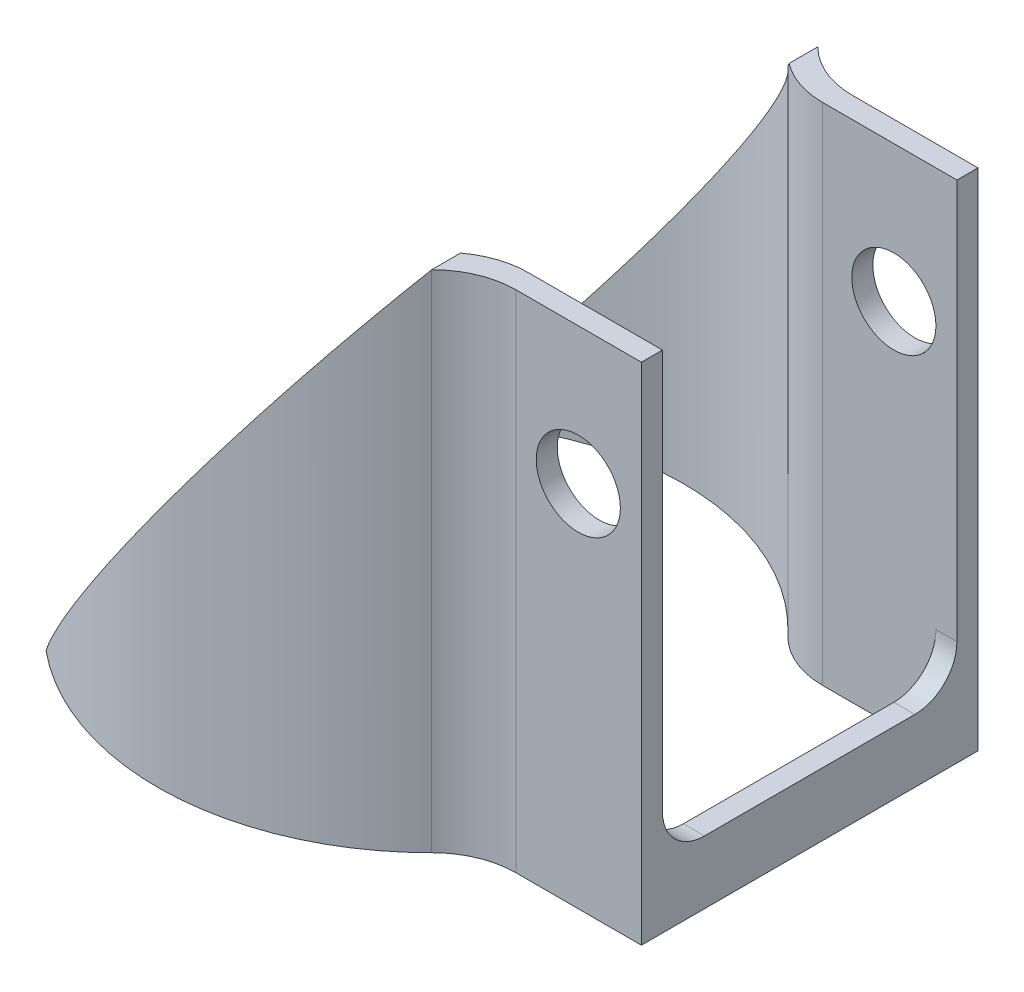
ISO-10303-21;
HEADER;
FILE_DESCRIPTION(('STEP AP214'),'2;1');
FILE_NAME('part.step','',(''),(''),'','','');
FILE_SCHEMA(('AUTOMOTIVE_DESIGN { 1 0 10303 214 1 1 1 1 }'));
ENDSEC;
DATA;
#1=APPLICATION_CONTEXT('core data for automotive mechanical design processes');
#2=APPLICATION_PROTOCOL_DEFINITION('international standard','automotive_design',2000,#1);
#3=PRODUCT_CONTEXT('',#1,'mechanical');
#4=PRODUCT('Part','Part','',(#3));
#5=PRODUCT_RELATED_PRODUCT_CATEGORY('part','',(#4));
#6=PRODUCT_DEFINITION_FORMATION('','',#4);
#7=PRODUCT_DEFINITION_CONTEXT('part definition',#1,'design');
#8=PRODUCT_DEFINITION('design','',#6,#7);
#9=PRODUCT_DEFINITION_SHAPE('','',#8);
#10=(LENGTH_UNIT() NAMED_UNIT(*) SI_UNIT(.MILLI.,.METRE.));
#11=(NAMED_UNIT(*) PLANE_ANGLE_UNIT() SI_UNIT($,.RADIAN.));
#12=(NAMED_UNIT(*) SI_UNIT($,.STERADIAN.) SOLID_ANGLE_UNIT());
#13=UNCERTAINTY_MEASURE_WITH_UNIT(LENGTH_MEASURE(1.E-05),#10,'distance_accuracy_value','');
#14=(GEOMETRIC_REPRESENTATION_CONTEXT(3) GLOBAL_UNCERTAINTY_ASSIGNED_CONTEXT((#13)) GLOBAL_UNIT_ASSIGNED_CONTEXT((#10,
#11,#12)) REPRESENTATION_CONTEXT('',''));
#15=CARTESIAN_POINT('',(0.,0.,0.));
#16=DIRECTION('',(0.,0.,1.));
#17=DIRECTION('',(1.,0.,0.));
#18=AXIS2_PLACEMENT_3D('',#15,#16,#17);
#19=CARTESIAN_POINT('',(0.,24.,0.));
#20=DIRECTION('',(0.,1.,0.));
#21=DIRECTION('',(0.,0.,1.));
#22=AXIS2_PLACEMENT_3D('',#19,#20,#21);
#23=PLANE('',#22);
#24=DIRECTION('',(0.,0.,-1.));
#25=VECTOR('',#24,1.);
#26=CARTESIAN_POINT('',(18.,24.,8.));
#27=LINE('',#26,#25);
#28=CARTESIAN_POINT('',(18.,24.,8.));
#29=VERTEX_POINT('',#28);
#30=CARTESIAN_POINT('',(18.,24.,7.));
#31=VERTEX_POINT('',#30);
#32=EDGE_CURVE('E189',#29,#31,#27,.T.);
#33=ORIENTED_EDGE('',*,*,#32,.T.);
#34=DIRECTION('',(1.,0.,0.));
#35=VECTOR('',#34,1.);
#36=CARTESIAN_POINT('',(17.,24.,7.));
#37=LINE('',#36,#35);
#38=CARTESIAN_POINT('',(11.6189500386223,24.,7.));
#39=VERTEX_POINT('',#38);
#40=EDGE_CURVE('E173',#39,#31,#37,.T.);
#41=ORIENTED_EDGE('',*,*,#40,.F.);
#42=CARTESIAN_POINT('',(11.6189500386223,24.,11.));
#43=DIRECTION('',(0.,1.,0.));
#44=DIRECTION('',(0.,0.,1.));
#45=AXIS2_PLACEMENT_3D('',#42,#43,#44);
#46=CIRCLE('',#45,4.);
#47=CARTESIAN_POINT('',(9.20827820731175,24.,7.80803174800781));
#48=VERTEX_POINT('',#47);
#49=EDGE_CURVE('E226',#39,#48,#46,.T.);
#50=ORIENTED_EDGE('',*,*,#49,.T.);
#51=DIRECTION('',(0.,0.,1.));
#52=VECTOR('',#51,1.);
#53=CARTESIAN_POINT('',(9.20827820731175,24.,-13.));
#54=LINE('',#53,#52);
#55=CARTESIAN_POINT('',(9.20827820731175,24.,9.17647058823528));
#56=VERTEX_POINT('',#55);
#57=EDGE_CURVE('E297',#48,#56,#54,.T.);
#58=ORIENTED_EDGE('',*,*,#57,.T.);
#59=CARTESIAN_POINT('',(12.0415945787923,24.,12.));
#60=DIRECTION('',(0.,1.,0.));
#61=DIRECTION('',(0.,0.,1.));
#62=AXIS2_PLACEMENT_3D('',#59,#60,#61);
#63=CIRCLE('',#62,4.);
#64=CARTESIAN_POINT('',(12.0415945787923,24.,8.));
#65=VERTEX_POINT('',#64);
#66=EDGE_CURVE('E251',#56,#65,#63,.F.);
#67=ORIENTED_EDGE('',*,*,#66,.T.);
#68=DIRECTION('',(1.,0.,0.));
#69=VECTOR('',#68,1.);
#70=CARTESIAN_POINT('',(18.,24.,8.));
#71=LINE('',#70,#69);
#72=EDGE_CURVE('E200',#65,#29,#71,.T.);
#73=ORIENTED_EDGE('',*,*,#72,.T.);
#74=EDGE_LOOP('',(#33,#41,#50,#58,#67,#73));
#75=FACE_BOUND('',#74,.T.);
#76=ADVANCED_FACE('F33',(#75),#23,.T.);
#77=CARTESIAN_POINT('',(18.,24.,8.));
#78=DIRECTION('',(-1.,0.,0.));
#79=DIRECTION('',(0.,0.,1.));
#80=AXIS2_PLACEMENT_3D('',#77,#78,#79);
#81=PLANE('',#80);
#82=DIRECTION('',(0.,-1.,0.));
#83=VECTOR('',#82,1.);
#84=CARTESIAN_POINT('',(18.,24.,7.));
#85=LINE('',#84,#83);
#86=CARTESIAN_POINT('',(18.,5.,7.));
#87=VERTEX_POINT('',#86);
#88=EDGE_CURVE('E181',#31,#87,#85,.T.);
#89=ORIENTED_EDGE('',*,*,#88,.F.);
#90=ORIENTED_EDGE('',*,*,#32,.F.);
#91=DIRECTION('',(0.,-1.,0.));
#92=VECTOR('',#91,1.);
#93=CARTESIAN_POINT('',(18.,24.,8.));
#94=LINE('',#93,#92);
#95=CARTESIAN_POINT('',(18.,0.,8.));
#96=VERTEX_POINT('',#95);
#97=EDGE_CURVE('E202',#29,#96,#94,.T.);
#98=ORIENTED_EDGE('',*,*,#97,.T.);
#99=DIRECTION('',(0.,0.,-1.));
#100=VECTOR('',#99,1.);
#101=CARTESIAN_POINT('',(18.,0.,8.));
#102=LINE('',#101,#100);
#103=CARTESIAN_POINT('',(18.,0.,-8.));
#104=VERTEX_POINT('',#103);
#105=EDGE_CURVE('E203',#96,#104,#102,.T.);
#106=ORIENTED_EDGE('',*,*,#105,.T.);
#107=DIRECTION('',(0.,-1.,0.));
#108=VECTOR('',#107,1.);
#109=CARTESIAN_POINT('',(18.,24.,-8.));
#110=LINE('',#109,#108);
#111=CARTESIAN_POINT('',(18.,24.,-8.));
#112=VERTEX_POINT('',#111);
#113=EDGE_CURVE('E188',#112,#104,#110,.T.);
#114=ORIENTED_EDGE('',*,*,#113,.F.);
#115=CARTESIAN_POINT('',(18.,24.,-7.00000000000001));
#116=VERTEX_POINT('',#115);
#117=EDGE_CURVE('E167',#116,#112,#27,.T.);
#118=ORIENTED_EDGE('',*,*,#117,.F.);
#119=DIRECTION('',(0.,-1.,0.));
#120=VECTOR('',#119,1.);
#121=CARTESIAN_POINT('',(18.,24.,-7.00000000000001));
#122=LINE('',#121,#120);
#123=CARTESIAN_POINT('',(18.,5.,-7.00000000000001));
#124=VERTEX_POINT('',#123);
#125=EDGE_CURVE('E177',#116,#124,#122,.T.);
#126=ORIENTED_EDGE('',*,*,#125,.T.);
#127=CARTESIAN_POINT('',(18.,5.,-5.));
#128=DIRECTION('',(-1.,0.,0.));
#129=DIRECTION('',(0.,0.,1.));
#130=AXIS2_PLACEMENT_3D('',#127,#128,#129);
#131=CIRCLE('',#130,2.);
#132=CARTESIAN_POINT('',(18.,3.,-5.));
#133=VERTEX_POINT('',#132);
#134=EDGE_CURVE('E41',#124,#133,#131,.T.);
#135=ORIENTED_EDGE('',*,*,#134,.T.);
#136=DIRECTION('',(0.,0.,-1.));
#137=VECTOR('',#136,1.);
#138=CARTESIAN_POINT('',(18.,3.,8.));
#139=LINE('',#138,#137);
#140=CARTESIAN_POINT('',(18.,3.,5.));
#141=VERTEX_POINT('',#140);
#142=EDGE_CURVE('E272',#141,#133,#139,.T.);
#143=ORIENTED_EDGE('',*,*,#142,.F.);
#144=CARTESIAN_POINT('',(18.,5.,5.));
#145=DIRECTION('',(-1.,0.,0.));
#146=DIRECTION('',(0.,0.,1.));
#147=AXIS2_PLACEMENT_3D('',#144,#145,#146);
#148=CIRCLE('',#147,2.);
#149=EDGE_CURVE('E267',#141,#87,#148,.T.);
#150=ORIENTED_EDGE('',*,*,#149,.T.);
#151=EDGE_LOOP('',(#89,#90,#98,#106,#114,#118,#126,#135,#143,#150));
#152=FACE_BOUND('',#151,.T.);
#153=ADVANCED_FACE('F185',(#152),#81,.F.);
#154=CARTESIAN_POINT('',(17.,24.,7.));
#155=DIRECTION('',(-1.,0.,0.));
#156=DIRECTION('',(0.,0.,1.));
#157=AXIS2_PLACEMENT_3D('',#154,#155,#156);
#158=PLANE('',#157);
#159=DIRECTION('',(0.,-1.,0.));
#160=VECTOR('',#159,1.);
#161=CARTESIAN_POINT('',(17.,24.,7.));
#162=LINE('',#161,#160);
#163=CARTESIAN_POINT('',(17.,5.,7.));
#164=VERTEX_POINT('',#163);
#165=CARTESIAN_POINT('',(17.,0.,7.));
#166=VERTEX_POINT('',#165);
#167=EDGE_CURVE('E316',#164,#166,#162,.T.);
#168=ORIENTED_EDGE('',*,*,#167,.F.);
#169=CARTESIAN_POINT('',(17.,5.,5.));
#170=DIRECTION('',(-1.,0.,0.));
#171=DIRECTION('',(0.,0.,1.));
#172=AXIS2_PLACEMENT_3D('',#169,#170,#171);
#173=CIRCLE('',#172,2.);
#174=CARTESIAN_POINT('',(17.,3.,5.));
#175=VERTEX_POINT('',#174);
#176=EDGE_CURVE('E269',#164,#175,#173,.F.);
#177=ORIENTED_EDGE('',*,*,#176,.T.);
#178=DIRECTION('',(0.,0.,-1.));
#179=VECTOR('',#178,1.);
#180=CARTESIAN_POINT('',(17.,3.,7.));
#181=LINE('',#180,#179);
#182=CARTESIAN_POINT('',(17.,3.,-5.));
#183=VERTEX_POINT('',#182);
#184=EDGE_CURVE('E278',#175,#183,#181,.T.);
#185=ORIENTED_EDGE('',*,*,#184,.T.);
#186=CARTESIAN_POINT('',(17.,5.,-5.));
#187=DIRECTION('',(-1.,0.,0.));
#188=DIRECTION('',(0.,0.,1.));
#189=AXIS2_PLACEMENT_3D('',#186,#187,#188);
#190=CIRCLE('',#189,2.);
#191=CARTESIAN_POINT('',(17.,5.,-7.));
#192=VERTEX_POINT('',#191);
#193=EDGE_CURVE('E11',#183,#192,#190,.F.);
#194=ORIENTED_EDGE('',*,*,#193,.T.);
#195=DIRECTION('',(0.,-1.,0.));
#196=VECTOR('',#195,1.);
#197=CARTESIAN_POINT('',(17.,24.,-7.));
#198=LINE('',#197,#196);
#199=CARTESIAN_POINT('',(17.,0.,-7.));
#200=VERTEX_POINT('',#199);
#201=EDGE_CURVE('E48',#192,#200,#198,.T.);
#202=ORIENTED_EDGE('',*,*,#201,.T.);
#203=DIRECTION('',(0.,0.,-1.));
#204=VECTOR('',#203,1.);
#205=CARTESIAN_POINT('',(17.,0.,7.));
#206=LINE('',#205,#204);
#207=EDGE_CURVE('E312',#166,#200,#206,.T.);
#208=ORIENTED_EDGE('',*,*,#207,.F.);
#209=EDGE_LOOP('',(#168,#177,#185,#194,#202,#208));
#210=FACE_BOUND('',#209,.T.);
#211=ADVANCED_FACE('F282',(#210),#158,.T.);
#212=CARTESIAN_POINT('',(0.,24.,0.));
#213=DIRECTION('',(0.,-1.,0.));
#214=DIRECTION('',(0.,0.,-1.));
#215=AXIS2_PLACEMENT_3D('',#212,#213,#214);
#216=CYLINDRICAL_SURFACE('',#215,13.);
#217=CARTESIAN_POINT('',(0.,0.,0.));
#218=DIRECTION('',(0.,1.,0.));
#219=DIRECTION('',(0.,0.,1.));
#220=AXIS2_PLACEMENT_3D('',#217,#218,#219);
#221=CIRCLE('',#220,13.);
#222=CARTESIAN_POINT('',(9.20827820731175,0.,-9.1764705882353));
#223=VERTEX_POINT('',#222);
#224=CARTESIAN_POINT('',(-8.27878892488248,0.,-10.0230561176341));
#225=VERTEX_POINT('',#224);
#226=EDGE_CURVE('E194',#223,#225,#221,.T.);
#227=ORIENTED_EDGE('',*,*,#226,.T.);
#228=CARTESIAN_POINT('',(0.,11.3621645468143,0.));
#229=DIRECTION('',(0.80821481299193,-0.58888777883432,0.));
#230=DIRECTION('',(-0.58888777883432,-0.80821481299193,0.));
#231=AXIS2_PLACEMENT_3D('',#228,#229,#230);
#232=ELLIPSE('',#231,22.0755133104188,13.);
#233=CARTESIAN_POINT('',(9.20827820731175,24.,-9.17647058823529));
#234=VERTEX_POINT('',#233);
#235=EDGE_CURVE('E311',#225,#234,#232,.T.);
#236=ORIENTED_EDGE('',*,*,#235,.T.);
#237=DIRECTION('',(0.,-1.,0.));
#238=VECTOR('',#237,1.);
#239=CARTESIAN_POINT('',(9.20827820731175,24.,-9.1764705882353));
#240=LINE('',#239,#238);
#241=EDGE_CURVE('E235',#234,#223,#240,.T.);
#242=ORIENTED_EDGE('',*,*,#241,.T.);
#243=EDGE_LOOP('',(#227,#236,#242));
#244=FACE_BOUND('',#243,.T.);
#245=ADVANCED_FACE('F374',(#244),#216,.T.);
#246=CARTESIAN_POINT('',(0.,24.,0.));
#247=DIRECTION('',(0.,-1.,0.));
#248=DIRECTION('',(0.,0.,-1.));
#249=AXIS2_PLACEMENT_3D('',#246,#247,#248);
#250=CYLINDRICAL_SURFACE('',#249,12.);
#251=CARTESIAN_POINT('',(0.,11.3621645468143,0.));
#252=DIRECTION('',(0.80821481299193,-0.58888777883432,0.));
#253=DIRECTION('',(-0.58888777883432,-0.80821481299193,0.));
#254=AXIS2_PLACEMENT_3D('',#251,#252,#253);
#255=ELLIPSE('',#254,20.377396901925,12.);
#256=CARTESIAN_POINT('',(-8.27878892488248,0.,-8.68686675028708));
#257=VERTEX_POINT('',#256);
#258=CARTESIAN_POINT('',(8.71421252896669,23.3219230994744,-8.25));
#259=VERTEX_POINT('',#258);
#260=EDGE_CURVE('E309',#257,#259,#255,.T.);
#261=ORIENTED_EDGE('',*,*,#260,.F.);
#262=CARTESIAN_POINT('',(0.,0.,0.));
#263=DIRECTION('',(0.,1.,0.));
#264=DIRECTION('',(0.,0.,1.));
#265=AXIS2_PLACEMENT_3D('',#262,#263,#264);
#266=CIRCLE('',#265,12.);
#267=CARTESIAN_POINT('',(8.71421252896669,0.,-8.25));
#268=VERTEX_POINT('',#267);
#269=EDGE_CURVE('E323',#268,#257,#266,.T.);
#270=ORIENTED_EDGE('',*,*,#269,.F.);
#271=DIRECTION('',(0.,-1.,0.));
#272=VECTOR('',#271,1.);
#273=CARTESIAN_POINT('',(8.71421252896669,24.,-8.25));
#274=LINE('',#273,#272);
#275=EDGE_CURVE('E223',#268,#259,#274,.F.);
#276=ORIENTED_EDGE('',*,*,#275,.T.);
#277=EDGE_LOOP('',(#261,#270,#276));
#278=FACE_BOUND('',#277,.T.);
#279=ADVANCED_FACE('F368',(#278),#250,.F.);
#280=DIRECTION('',(-1.,0.,0.));
#281=VECTOR('',#280,1.);
#282=CARTESIAN_POINT('',(17.,24.,-7.));
#283=LINE('',#282,#281);
#284=CARTESIAN_POINT('',(11.6189500386222,24.,-7.));
#285=VERTEX_POINT('',#284);
#286=EDGE_CURVE('E162',#116,#285,#283,.T.);
#287=ORIENTED_EDGE('',*,*,#286,.F.);
#288=ORIENTED_EDGE('',*,*,#117,.T.);
#289=DIRECTION('',(-1.,0.,0.));
#290=VECTOR('',#289,1.);
#291=CARTESIAN_POINT('',(18.,24.,-8.));
#292=LINE('',#291,#290);
#293=CARTESIAN_POINT('',(12.0415945787923,24.,-8.));
#294=VERTEX_POINT('',#293);
#295=EDGE_CURVE('E193',#112,#294,#292,.T.);
#296=ORIENTED_EDGE('',*,*,#295,.T.);
#297=CARTESIAN_POINT('',(12.0415945787923,24.,-12.));
#298=DIRECTION('',(0.,1.,0.));
#299=DIRECTION('',(0.,0.,1.));
#300=AXIS2_PLACEMENT_3D('',#297,#298,#299);
#301=CIRCLE('',#300,4.);
#302=EDGE_CURVE('E245',#294,#234,#301,.F.);
#303=ORIENTED_EDGE('',*,*,#302,.T.);
#304=CARTESIAN_POINT('',(9.20827820731175,24.,-7.80803174800781));
#305=VERTEX_POINT('',#304);
#306=EDGE_CURVE('E300',#234,#305,#54,.T.);
#307=ORIENTED_EDGE('',*,*,#306,.T.);
#308=CARTESIAN_POINT('',(11.6189500386222,24.,-11.));
#309=DIRECTION('',(0.,1.,0.));
#310=DIRECTION('',(0.,0.,1.));
#311=AXIS2_PLACEMENT_3D('',#308,#309,#310);
#312=CIRCLE('',#311,4.);
#313=EDGE_CURVE('E171',#305,#285,#312,.T.);
#314=ORIENTED_EDGE('',*,*,#313,.T.);
#315=EDGE_LOOP('',(#287,#288,#296,#303,#307,#314));
#316=FACE_BOUND('',#315,.T.);
#317=ADVANCED_FACE('F164',(#316),#23,.T.);
#318=CARTESIAN_POINT('',(0.,0.,0.));
#319=DIRECTION('',(0.,1.,0.));
#320=DIRECTION('',(0.,0.,1.));
#321=AXIS2_PLACEMENT_3D('',#318,#319,#320);
#322=PLANE('',#321);
#323=CARTESIAN_POINT('',(-8.27878892488248,0.,10.0230561176341));
#324=VERTEX_POINT('',#323);
#325=CARTESIAN_POINT('',(9.20827820731175,0.,9.17647058823529));
#326=VERTEX_POINT('',#325);
#327=EDGE_CURVE('E208',#324,#326,#221,.T.);
#328=ORIENTED_EDGE('',*,*,#327,.F.);
#329=DIRECTION('',(0.,0.,1.));
#330=VECTOR('',#329,1.);
#331=CARTESIAN_POINT('',(-8.27878892488248,0.,-13.));
#332=LINE('',#331,#330);
#333=CARTESIAN_POINT('',(-8.27878892488248,0.,8.68686675028708));
#334=VERTEX_POINT('',#333);
#335=EDGE_CURVE('E296',#334,#324,#332,.T.);
#336=ORIENTED_EDGE('',*,*,#335,.F.);
#337=CARTESIAN_POINT('',(8.71421252896669,0.,8.25));
#338=VERTEX_POINT('',#337);
#339=EDGE_CURVE('E322',#334,#338,#266,.T.);
#340=ORIENTED_EDGE('',*,*,#339,.T.);
#341=CARTESIAN_POINT('',(11.6189500386223,0.,11.));
#342=DIRECTION('',(0.,1.,0.));
#343=DIRECTION('',(0.,0.,1.));
#344=AXIS2_PLACEMENT_3D('',#341,#342,#343);
#345=CIRCLE('',#344,4.);
#346=CARTESIAN_POINT('',(11.6189500386223,0.,7.));
#347=VERTEX_POINT('',#346);
#348=EDGE_CURVE('E216',#338,#347,#345,.F.);
#349=ORIENTED_EDGE('',*,*,#348,.T.);
#350=DIRECTION('',(1.,0.,0.));
#351=VECTOR('',#350,1.);
#352=CARTESIAN_POINT('',(17.,0.,7.));
#353=LINE('',#352,#351);
#354=EDGE_CURVE('E174',#347,#166,#353,.T.);
#355=ORIENTED_EDGE('',*,*,#354,.T.);
#356=ORIENTED_EDGE('',*,*,#207,.T.);
#357=DIRECTION('',(-1.,0.,0.));
#358=VECTOR('',#357,1.);
#359=CARTESIAN_POINT('',(17.,0.,-7.));
#360=LINE('',#359,#358);
#361=CARTESIAN_POINT('',(11.6189500386222,0.,-7.));
#362=VERTEX_POINT('',#361);
#363=EDGE_CURVE('E319',#200,#362,#360,.T.);
#364=ORIENTED_EDGE('',*,*,#363,.T.);
#365=CARTESIAN_POINT('',(11.6189500386222,0.,-11.));
#366=DIRECTION('',(0.,1.,0.));
#367=DIRECTION('',(0.,0.,1.));
#368=AXIS2_PLACEMENT_3D('',#365,#366,#367);
#369=CIRCLE('',#368,4.);
#370=EDGE_CURVE('E218',#362,#268,#369,.F.);
#371=ORIENTED_EDGE('',*,*,#370,.T.);
#372=ORIENTED_EDGE('',*,*,#269,.T.);
#373=EDGE_CURVE('E301',#225,#257,#332,.T.);
#374=ORIENTED_EDGE('',*,*,#373,.F.);
#375=ORIENTED_EDGE('',*,*,#226,.F.);
#376=CARTESIAN_POINT('',(12.0415945787923,0.,-12.));
#377=DIRECTION('',(0.,1.,0.));
#378=DIRECTION('',(0.,0.,1.));
#379=AXIS2_PLACEMENT_3D('',#376,#377,#378);
#380=CIRCLE('',#379,4.);
#381=CARTESIAN_POINT('',(12.0415945787923,0.,-8.));
#382=VERTEX_POINT('',#381);
#383=EDGE_CURVE('E243',#223,#382,#380,.T.);
#384=ORIENTED_EDGE('',*,*,#383,.T.);
#385=DIRECTION('',(-1.,0.,0.));
#386=VECTOR('',#385,1.);
#387=CARTESIAN_POINT('',(18.,0.,-8.));
#388=LINE('',#387,#386);
#389=EDGE_CURVE('E205',#104,#382,#388,.T.);
#390=ORIENTED_EDGE('',*,*,#389,.F.);
#391=ORIENTED_EDGE('',*,*,#105,.F.);
#392=DIRECTION('',(1.,0.,0.));
#393=VECTOR('',#392,1.);
#394=CARTESIAN_POINT('',(18.,0.,8.));
#395=LINE('',#394,#393);
#396=CARTESIAN_POINT('',(12.0415945787923,0.,8.));
#397=VERTEX_POINT('',#396);
#398=EDGE_CURVE('E190',#397,#96,#395,.T.);
#399=ORIENTED_EDGE('',*,*,#398,.F.);
#400=CARTESIAN_POINT('',(12.0415945787923,0.,12.));
#401=DIRECTION('',(0.,1.,0.));
#402=DIRECTION('',(0.,0.,1.));
#403=AXIS2_PLACEMENT_3D('',#400,#401,#402);
#404=CIRCLE('',#403,4.);
#405=EDGE_CURVE('E248',#397,#326,#404,.T.);
#406=ORIENTED_EDGE('',*,*,#405,.T.);
#407=EDGE_LOOP('',(#328,#336,#340,#349,#355,#356,#364,#371,#372,#374,#375,#384,#390,#391,#399,#406));
#408=FACE_BOUND('',#407,.T.);
#409=ADVANCED_FACE('F334',(#408),#322,.F.);
#410=CARTESIAN_POINT('',(18.,24.,-8.));
#411=DIRECTION('',(0.,0.,1.));
#412=DIRECTION('',(1.,0.,0.));
#413=AXIS2_PLACEMENT_3D('',#410,#411,#412);
#414=PLANE('',#413);
#415=CARTESIAN_POINT('',(15.,17.5,-8.));
#416=DIRECTION('',(0.,0.,1.));
#417=DIRECTION('',(1.,0.,0.));
#418=AXIS2_PLACEMENT_3D('',#415,#416,#417);
#419=CIRCLE('',#418,2.);
#420=CARTESIAN_POINT('',(17.,17.5,-8.));
#421=VERTEX_POINT('',#420);
#422=EDGE_CURVE('E293',#421,#421,#419,.T.);
#423=ORIENTED_EDGE('',*,*,#422,.T.);
#424=EDGE_LOOP('',(#423));
#425=FACE_BOUND('',#424,.T.);
#426=ORIENTED_EDGE('',*,*,#389,.T.);
#427=DIRECTION('',(0.,1.,0.));
#428=VECTOR('',#427,1.);
#429=CARTESIAN_POINT('',(12.0415945787923,24.,-8.));
#430=LINE('',#429,#428);
#431=EDGE_CURVE('E238',#382,#294,#430,.T.);
#432=ORIENTED_EDGE('',*,*,#431,.T.);
#433=ORIENTED_EDGE('',*,*,#295,.F.);
#434=ORIENTED_EDGE('',*,*,#113,.T.);
#435=EDGE_LOOP('',(#426,#432,#433,#434));
#436=FACE_BOUND('',#435,.T.);
#437=ADVANCED_FACE('F373',(#425,#436),#414,.F.);
#438=DIRECTION('',(0.,-1.,0.));
#439=VECTOR('',#438,1.);
#440=CARTESIAN_POINT('',(9.20827820731175,24.,9.1764705882353));
#441=LINE('',#440,#439);
#442=EDGE_CURVE('E232',#326,#56,#441,.F.);
#443=ORIENTED_EDGE('',*,*,#442,.T.);
#444=EDGE_CURVE('E313',#56,#324,#232,.T.);
#445=ORIENTED_EDGE('',*,*,#444,.T.);
#446=ORIENTED_EDGE('',*,*,#327,.T.);
#447=EDGE_LOOP('',(#443,#445,#446));
#448=FACE_BOUND('',#447,.T.);
#449=ADVANCED_FACE('F383',(#448),#216,.T.);
#450=CARTESIAN_POINT('',(18.,24.,8.));
#451=DIRECTION('',(0.,0.,-1.));
#452=DIRECTION('',(-1.,0.,0.));
#453=AXIS2_PLACEMENT_3D('',#450,#451,#452);
#454=PLANE('',#453);
#455=CARTESIAN_POINT('',(15.,17.5,8.));
#456=DIRECTION('',(0.,0.,1.));
#457=DIRECTION('',(1.,0.,0.));
#458=AXIS2_PLACEMENT_3D('',#455,#456,#457);
#459=CIRCLE('',#458,2.);
#460=CARTESIAN_POINT('',(17.,17.5,8.));
#461=VERTEX_POINT('',#460);
#462=EDGE_CURVE('E258',#461,#461,#459,.T.);
#463=ORIENTED_EDGE('',*,*,#462,.F.);
#464=EDGE_LOOP('',(#463));
#465=FACE_BOUND('',#464,.T.);
#466=ORIENTED_EDGE('',*,*,#72,.F.);
#467=DIRECTION('',(0.,1.,0.));
#468=VECTOR('',#467,1.);
#469=CARTESIAN_POINT('',(12.0415945787923,0.,8.));
#470=LINE('',#469,#468);
#471=EDGE_CURVE('E240',#65,#397,#470,.F.);
#472=ORIENTED_EDGE('',*,*,#471,.T.);
#473=ORIENTED_EDGE('',*,*,#398,.T.);
#474=ORIENTED_EDGE('',*,*,#97,.F.);
#475=EDGE_LOOP('',(#466,#472,#473,#474));
#476=FACE_BOUND('',#475,.T.);
#477=ADVANCED_FACE('F395',(#465,#476),#454,.F.);
#478=CARTESIAN_POINT('',(17.,24.,-7.));
#479=DIRECTION('',(0.,0.,1.));
#480=DIRECTION('',(1.,0.,0.));
#481=AXIS2_PLACEMENT_3D('',#478,#479,#480);
#482=PLANE('',#481);
#483=CARTESIAN_POINT('',(15.,17.5,-7.));
#484=DIRECTION('',(0.,0.,1.));
#485=DIRECTION('',(1.,0.,0.));
#486=AXIS2_PLACEMENT_3D('',#483,#484,#485);
#487=CIRCLE('',#486,2.);
#488=CARTESIAN_POINT('',(17.,17.5,-7.));
#489=VERTEX_POINT('',#488);
#490=EDGE_CURVE('E257',#489,#489,#487,.T.);
#491=ORIENTED_EDGE('',*,*,#490,.F.);
#492=EDGE_LOOP('',(#491));
#493=FACE_BOUND('',#492,.T.);
#494=ORIENTED_EDGE('',*,*,#201,.F.);
#495=DIRECTION('',(1.,0.,0.));
#496=VECTOR('',#495,1.);
#497=CARTESIAN_POINT('',(18.,5.,-7.));
#498=LINE('',#497,#496);
#499=EDGE_CURVE('E179',#192,#124,#498,.T.);
#500=ORIENTED_EDGE('',*,*,#499,.T.);
#501=ORIENTED_EDGE('',*,*,#125,.F.);
#502=ORIENTED_EDGE('',*,*,#286,.T.);
#503=DIRECTION('',(0.,-1.,0.));
#504=VECTOR('',#503,1.);
#505=CARTESIAN_POINT('',(11.6189500386222,24.,-7.));
#506=LINE('',#505,#504);
#507=EDGE_CURVE('E214',#285,#362,#506,.T.);
#508=ORIENTED_EDGE('',*,*,#507,.T.);
#509=ORIENTED_EDGE('',*,*,#363,.F.);
#510=EDGE_LOOP('',(#494,#500,#501,#502,#508,#509));
#511=FACE_BOUND('',#510,.T.);
#512=ADVANCED_FACE('F178',(#493,#511),#482,.T.);
#513=CARTESIAN_POINT('',(8.71421252896669,23.3219230994744,8.25));
#514=VERTEX_POINT('',#513);
#515=EDGE_CURVE('E306',#514,#334,#255,.T.);
#516=ORIENTED_EDGE('',*,*,#515,.F.);
#517=DIRECTION('',(0.,-1.,0.));
#518=VECTOR('',#517,1.);
#519=CARTESIAN_POINT('',(8.71421252896669,24.,8.25));
#520=LINE('',#519,#518);
#521=EDGE_CURVE('E220',#514,#338,#520,.T.);
#522=ORIENTED_EDGE('',*,*,#521,.T.);
#523=ORIENTED_EDGE('',*,*,#339,.F.);
#524=EDGE_LOOP('',(#516,#522,#523));
#525=FACE_BOUND('',#524,.T.);
#526=ADVANCED_FACE('F377',(#525),#250,.F.);
#527=CARTESIAN_POINT('',(17.,24.,7.));
#528=DIRECTION('',(0.,0.,-1.));
#529=DIRECTION('',(-1.,0.,0.));
#530=AXIS2_PLACEMENT_3D('',#527,#528,#529);
#531=PLANE('',#530);
#532=CARTESIAN_POINT('',(15.,17.5,7.));
#533=DIRECTION('',(0.,0.,-1.));
#534=DIRECTION('',(-1.,0.,0.));
#535=AXIS2_PLACEMENT_3D('',#532,#533,#534);
#536=CIRCLE('',#535,2.);
#537=CARTESIAN_POINT('',(13.,17.5,7.));
#538=VERTEX_POINT('',#537);
#539=EDGE_CURVE('E254',#538,#538,#536,.T.);
#540=ORIENTED_EDGE('',*,*,#539,.F.);
#541=EDGE_LOOP('',(#540));
#542=FACE_BOUND('',#541,.T.);
#543=ORIENTED_EDGE('',*,*,#88,.T.);
#544=DIRECTION('',(1.,0.,0.));
#545=VECTOR('',#544,1.);
#546=CARTESIAN_POINT('',(17.,5.,7.));
#547=LINE('',#546,#545);
#548=EDGE_CURVE('E263',#87,#164,#547,.F.);
#549=ORIENTED_EDGE('',*,*,#548,.T.);
#550=ORIENTED_EDGE('',*,*,#167,.T.);
#551=ORIENTED_EDGE('',*,*,#354,.F.);
#552=DIRECTION('',(0.,-1.,0.));
#553=VECTOR('',#552,1.);
#554=CARTESIAN_POINT('',(11.6189500386223,24.,7.));
#555=LINE('',#554,#553);
#556=EDGE_CURVE('E230',#347,#39,#555,.F.);
#557=ORIENTED_EDGE('',*,*,#556,.T.);
#558=ORIENTED_EDGE('',*,*,#40,.T.);
#559=EDGE_LOOP('',(#543,#549,#550,#551,#557,#558));
#560=FACE_BOUND('',#559,.T.);
#561=ADVANCED_FACE('F329',(#542,#560),#531,.T.);
#562=CARTESIAN_POINT('',(11.6189500386222,24.,-11.));
#563=DIRECTION('',(0.,-1.,0.));
#564=DIRECTION('',(0.,0.,-1.));
#565=AXIS2_PLACEMENT_3D('',#562,#563,#564);
#566=CYLINDRICAL_SURFACE('',#565,4.);
#567=CARTESIAN_POINT('',(11.6189500386222,27.3085092836944,-11.));
#568=DIRECTION('',(0.80821481299193,-0.58888777883432,0.));
#569=DIRECTION('',(-0.58888777883432,-0.80821481299193,0.));
#570=AXIS2_PLACEMENT_3D('',#567,#568,#569);
#571=ELLIPSE('',#570,6.79246563397501,4.);
#572=EDGE_CURVE('E308',#259,#305,#571,.F.);
#573=ORIENTED_EDGE('',*,*,#572,.F.);
#574=ORIENTED_EDGE('',*,*,#275,.F.);
#575=ORIENTED_EDGE('',*,*,#370,.F.);
#576=ORIENTED_EDGE('',*,*,#507,.F.);
#577=ORIENTED_EDGE('',*,*,#313,.F.);
#578=EDGE_LOOP('',(#573,#574,#575,#576,#577));
#579=FACE_BOUND('',#578,.T.);
#580=ADVANCED_FACE('F393',(#579),#566,.T.);
#581=CARTESIAN_POINT('',(11.6189500386223,24.,11.));
#582=DIRECTION('',(0.,-1.,0.));
#583=DIRECTION('',(0.,0.,-1.));
#584=AXIS2_PLACEMENT_3D('',#581,#582,#583);
#585=CYLINDRICAL_SURFACE('',#584,4.);
#586=CARTESIAN_POINT('',(11.6189500386223,27.3085092836944,11.));
#587=DIRECTION('',(0.80821481299193,-0.58888777883432,0.));
#588=DIRECTION('',(-0.58888777883432,-0.80821481299193,0.));
#589=AXIS2_PLACEMENT_3D('',#586,#587,#588);
#590=ELLIPSE('',#589,6.79246563397501,4.);
#591=EDGE_CURVE('E304',#48,#514,#590,.F.);
#592=ORIENTED_EDGE('',*,*,#591,.F.);
#593=ORIENTED_EDGE('',*,*,#49,.F.);
#594=ORIENTED_EDGE('',*,*,#556,.F.);
#595=ORIENTED_EDGE('',*,*,#348,.F.);
#596=ORIENTED_EDGE('',*,*,#521,.F.);
#597=EDGE_LOOP('',(#592,#593,#594,#595,#596));
#598=FACE_BOUND('',#597,.T.);
#599=ADVANCED_FACE('F341',(#598),#585,.T.);
#600=CARTESIAN_POINT('',(12.0415945787923,24.,-12.));
#601=DIRECTION('',(0.,-1.,0.));
#602=DIRECTION('',(0.,0.,-1.));
#603=AXIS2_PLACEMENT_3D('',#600,#601,#602);
#604=CYLINDRICAL_SURFACE('',#603,4.);
#605=ORIENTED_EDGE('',*,*,#302,.F.);
#606=ORIENTED_EDGE('',*,*,#431,.F.);
#607=ORIENTED_EDGE('',*,*,#383,.F.);
#608=ORIENTED_EDGE('',*,*,#241,.F.);
#609=EDGE_LOOP('',(#605,#606,#607,#608));
#610=FACE_BOUND('',#609,.T.);
#611=ADVANCED_FACE('F417',(#610),#604,.F.);
#612=CARTESIAN_POINT('',(12.0415945787923,24.,12.));
#613=DIRECTION('',(0.,-1.,0.));
#614=DIRECTION('',(0.,0.,-1.));
#615=AXIS2_PLACEMENT_3D('',#612,#613,#614);
#616=CYLINDRICAL_SURFACE('',#615,4.);
#617=ORIENTED_EDGE('',*,*,#66,.F.);
#618=ORIENTED_EDGE('',*,*,#442,.F.);
#619=ORIENTED_EDGE('',*,*,#405,.F.);
#620=ORIENTED_EDGE('',*,*,#471,.F.);
#621=EDGE_LOOP('',(#617,#618,#619,#620));
#622=FACE_BOUND('',#621,.T.);
#623=ADVANCED_FACE('F423',(#622),#616,.F.);
#624=CARTESIAN_POINT('',(-8.27878892488248,0.,-13.));
#625=DIRECTION('',(0.80821481299193,-0.58888777883432,0.));
#626=DIRECTION('',(0.58888777883432,0.80821481299193,0.));
#627=AXIS2_PLACEMENT_3D('',#624,#625,#626);
#628=PLANE('',#627);
#629=ORIENTED_EDGE('',*,*,#57,.F.);
#630=ORIENTED_EDGE('',*,*,#591,.T.);
#631=ORIENTED_EDGE('',*,*,#515,.T.);
#632=ORIENTED_EDGE('',*,*,#335,.T.);
#633=ORIENTED_EDGE('',*,*,#444,.F.);
#634=EDGE_LOOP('',(#629,#630,#631,#632,#633));
#635=FACE_BOUND('',#634,.T.);
#636=ADVANCED_FACE('F399',(#635),#628,.F.);
#637=ORIENTED_EDGE('',*,*,#373,.T.);
#638=ORIENTED_EDGE('',*,*,#260,.T.);
#639=ORIENTED_EDGE('',*,*,#572,.T.);
#640=ORIENTED_EDGE('',*,*,#306,.F.);
#641=ORIENTED_EDGE('',*,*,#235,.F.);
#642=EDGE_LOOP('',(#637,#638,#639,#640,#641));
#643=FACE_BOUND('',#642,.T.);
#644=ADVANCED_FACE('F406',(#643),#628,.F.);
#645=CARTESIAN_POINT('',(15.,17.5,-13.));
#646=DIRECTION('',(0.,0.,1.));
#647=DIRECTION('',(1.,0.,0.));
#648=AXIS2_PLACEMENT_3D('',#645,#646,#647);
#649=CYLINDRICAL_SURFACE('',#648,2.);
#650=ORIENTED_EDGE('',*,*,#539,.T.);
#651=EDGE_LOOP('',(#650));
#652=FACE_BOUND('',#651,.T.);
#653=ORIENTED_EDGE('',*,*,#462,.T.);
#654=EDGE_LOOP('',(#653));
#655=FACE_BOUND('',#654,.T.);
#656=ADVANCED_FACE('F446',(#652,#655),#649,.F.);
#657=ORIENTED_EDGE('',*,*,#490,.T.);
#658=EDGE_LOOP('',(#657));
#659=FACE_BOUND('',#658,.T.);
#660=ORIENTED_EDGE('',*,*,#422,.F.);
#661=EDGE_LOOP('',(#660));
#662=FACE_BOUND('',#661,.T.);
#663=ADVANCED_FACE('F356',(#659,#662),#649,.F.);
#664=CARTESIAN_POINT('',(-8.27878892488248,3.,-7.00000000000001));
#665=DIRECTION('',(0.,1.,0.));
#666=DIRECTION('',(0.,0.,1.));
#667=AXIS2_PLACEMENT_3D('',#664,#665,#666);
#668=PLANE('',#667);
#669=ORIENTED_EDGE('',*,*,#184,.F.);
#670=DIRECTION('',(1.,0.,0.));
#671=VECTOR('',#670,1.);
#672=CARTESIAN_POINT('',(18.,3.,5.));
#673=LINE('',#672,#671);
#674=EDGE_CURVE('E260',#175,#141,#673,.T.);
#675=ORIENTED_EDGE('',*,*,#674,.T.);
#676=ORIENTED_EDGE('',*,*,#142,.T.);
#677=DIRECTION('',(1.,0.,0.));
#678=VECTOR('',#677,1.);
#679=CARTESIAN_POINT('',(17.,3.,-5.));
#680=LINE('',#679,#678);
#681=EDGE_CURVE('E253',#133,#183,#680,.F.);
#682=ORIENTED_EDGE('',*,*,#681,.T.);
#683=EDGE_LOOP('',(#669,#675,#676,#682));
#684=FACE_BOUND('',#683,.T.);
#685=ADVANCED_FACE('F275',(#684),#668,.T.);
#686=CARTESIAN_POINT('',(-8.27878892488248,5.,5.));
#687=DIRECTION('',(-1.,0.,0.));
#688=DIRECTION('',(0.,0.,1.));
#689=AXIS2_PLACEMENT_3D('',#686,#687,#688);
#690=CYLINDRICAL_SURFACE('',#689,2.);
#691=ORIENTED_EDGE('',*,*,#176,.F.);
#692=ORIENTED_EDGE('',*,*,#548,.F.);
#693=ORIENTED_EDGE('',*,*,#149,.F.);
#694=ORIENTED_EDGE('',*,*,#674,.F.);
#695=EDGE_LOOP('',(#691,#692,#693,#694));
#696=FACE_BOUND('',#695,.T.);
#697=ADVANCED_FACE('F350',(#696),#690,.F.);
#698=CARTESIAN_POINT('',(17.,5.,-5.));
#699=DIRECTION('',(-1.,0.,0.));
#700=DIRECTION('',(0.,0.,1.));
#701=AXIS2_PLACEMENT_3D('',#698,#699,#700);
#702=CYLINDRICAL_SURFACE('',#701,2.);
#703=ORIENTED_EDGE('',*,*,#193,.F.);
#704=ORIENTED_EDGE('',*,*,#681,.F.);
#705=ORIENTED_EDGE('',*,*,#134,.F.);
#706=ORIENTED_EDGE('',*,*,#499,.F.);
#707=EDGE_LOOP('',(#703,#704,#705,#706));
#708=FACE_BOUND('',#707,.T.);
#709=ADVANCED_FACE('F35',(#708),#702,.F.);
#710=CLOSED_SHELL('',(#76,#153,#211,#245,#279,#317,#409,#437,#449,#477,#512,#526,#561,#580,#599,
#611,#623,#636,#644,#656,#663,#685,#697,#709));
#711=MANIFOLD_SOLID_BREP('B2',#710);
#712=ADVANCED_BREP_SHAPE_REPRESENTATION('',(#18,#711),#14);
#713=SHAPE_DEFINITION_REPRESENTATION(#9,#712);
ENDSEC;
END-ISO-10303-21;
